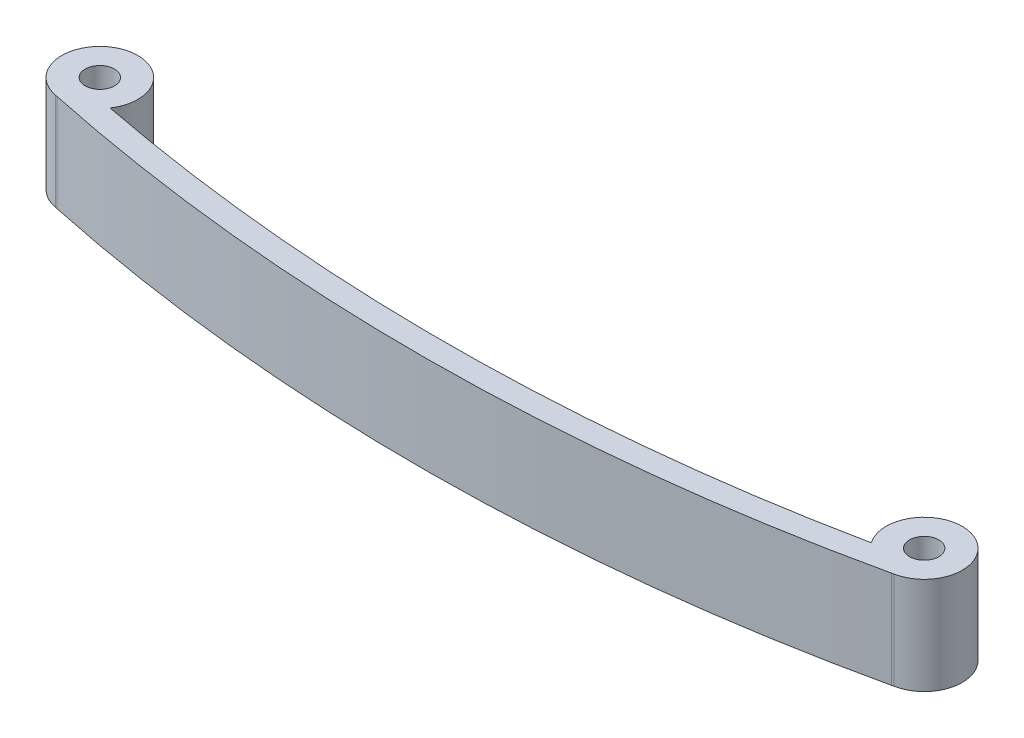
ISO-10303-21;
HEADER;
FILE_DESCRIPTION(('STEP AP214'),'2;1');
FILE_NAME('part.step','',(''),(''),'','','');
FILE_SCHEMA(('AUTOMOTIVE_DESIGN { 1 0 10303 214 1 1 1 1 }'));
ENDSEC;
DATA;
#1=APPLICATION_CONTEXT('core data for automotive mechanical design processes');
#2=APPLICATION_PROTOCOL_DEFINITION('international standard','automotive_design',2000,#1);
#3=PRODUCT_CONTEXT('',#1,'mechanical');
#4=PRODUCT('Part','Part','',(#3));
#5=PRODUCT_RELATED_PRODUCT_CATEGORY('part','',(#4));
#6=PRODUCT_DEFINITION_FORMATION('','',#4);
#7=PRODUCT_DEFINITION_CONTEXT('part definition',#1,'design');
#8=PRODUCT_DEFINITION('design','',#6,#7);
#9=PRODUCT_DEFINITION_SHAPE('','',#8);
#10=(LENGTH_UNIT() NAMED_UNIT(*) SI_UNIT(.MILLI.,.METRE.));
#11=(NAMED_UNIT(*) PLANE_ANGLE_UNIT() SI_UNIT($,.RADIAN.));
#12=(NAMED_UNIT(*) SI_UNIT($,.STERADIAN.) SOLID_ANGLE_UNIT());
#13=UNCERTAINTY_MEASURE_WITH_UNIT(LENGTH_MEASURE(1.E-05),#10,'distance_accuracy_value','');
#14=(GEOMETRIC_REPRESENTATION_CONTEXT(3) GLOBAL_UNCERTAINTY_ASSIGNED_CONTEXT((#13)) GLOBAL_UNIT_ASSIGNED_CONTEXT((#10,
#11,#12)) REPRESENTATION_CONTEXT('',''));
#15=CARTESIAN_POINT('',(0.,0.,0.));
#16=DIRECTION('',(0.,0.,1.));
#17=DIRECTION('',(1.,0.,0.));
#18=AXIS2_PLACEMENT_3D('',#15,#16,#17);
#19=CARTESIAN_POINT('',(-0.864955357142889,8.3,-164.510629845203));
#20=DIRECTION('',(0.,1.,0.));
#21=DIRECTION('',(0.,0.,1.));
#22=AXIS2_PLACEMENT_3D('',#19,#20,#21);
#23=PLANE('',#22);
#24=CARTESIAN_POINT('',(-35.,8.3,-4.14258073909656));
#25=DIRECTION('',(0.,1.,0.));
#26=DIRECTION('',(0.,0.,1.));
#27=AXIS2_PLACEMENT_3D('',#24,#25,#26);
#28=CIRCLE('',#27,1.25);
#29=CARTESIAN_POINT('',(-35.,8.3,-2.89258073909657));
#30=VERTEX_POINT('',#29);
#31=EDGE_CURVE('E134',#30,#30,#28,.T.);
#32=ORIENTED_EDGE('',*,*,#31,.F.);
#33=EDGE_LOOP('',(#32));
#34=FACE_BOUND('',#33,.T.);
#35=CARTESIAN_POINT('',(-0.864955357142889,8.3,-164.510629845203));
#36=DIRECTION('',(0.,-1.,0.));
#37=DIRECTION('',(0.,0.,1.));
#38=AXIS2_PLACEMENT_3D('',#35,#36,#37);
#39=CIRCLE('',#38,165.210703971618);
#40=CARTESIAN_POINT('',(32.3290587197964,8.3,-2.66893516717083));
#41=VERTEX_POINT('',#40);
#42=CARTESIAN_POINT('',(-32.3092176120712,8.3,-2.31989312438794));
#43=VERTEX_POINT('',#42);
#44=EDGE_CURVE('E146',#41,#43,#39,.T.);
#45=ORIENTED_EDGE('',*,*,#44,.T.);
#46=CARTESIAN_POINT('',(-35.,8.3,-4.14258073909656));
#47=DIRECTION('',(0.,1.,0.));
#48=DIRECTION('',(0.,0.,1.));
#49=AXIS2_PLACEMENT_3D('',#46,#47,#48);
#50=CIRCLE('',#49,3.25);
#51=CARTESIAN_POINT('',(-35.5757158370828,8.3,-0.943979283001734));
#52=VERTEX_POINT('',#51);
#53=EDGE_CURVE('E94',#43,#52,#50,.T.);
#54=ORIENTED_EDGE('',*,*,#53,.T.);
#55=DIRECTION('',(0.97628943196104,0.,0.216469270431603));
#56=VECTOR('',#55,1.);
#57=CARTESIAN_POINT('',(-35.413230424207,8.3,-0.907951955828518));
#58=LINE('',#57,#56);
#59=CARTESIAN_POINT('',(-35.413230424207,8.3,-0.907951955828545));
#60=VERTEX_POINT('',#59);
#61=EDGE_CURVE('E107',#52,#60,#58,.T.);
#62=ORIENTED_EDGE('',*,*,#61,.T.);
#63=CARTESIAN_POINT('',(-0.864955357142889,8.3,-164.510629845203));
#64=DIRECTION('',(0.,1.,0.));
#65=DIRECTION('',(0.,0.,1.));
#66=AXIS2_PLACEMENT_3D('',#63,#64,#65);
#67=CIRCLE('',#66,167.210703971618);
#68=CARTESIAN_POINT('',(35.4341722962853,8.3,-1.28749161325972));
#69=VERTEX_POINT('',#68);
#70=EDGE_CURVE('E101',#60,#69,#67,.T.);
#71=ORIENTED_EDGE('',*,*,#70,.T.);
#72=DIRECTION('',(0.974629450610067,0.,-0.223824560769186));
#73=VECTOR('',#72,1.);
#74=CARTESIAN_POINT('',(35.4341722962853,8.3,-1.28749161325972));
#75=LINE('',#74,#73);
#76=CARTESIAN_POINT('',(35.6227279714257,8.3,-1.33079359961198));
#77=VERTEX_POINT('',#76);
#78=EDGE_CURVE('E105',#69,#77,#75,.T.);
#79=ORIENTED_EDGE('',*,*,#78,.T.);
#80=CARTESIAN_POINT('',(35.,8.3,-4.52057570402037));
#81=DIRECTION('',(0.,1.,0.));
#82=DIRECTION('',(0.,0.,1.));
#83=AXIS2_PLACEMENT_3D('',#80,#81,#82);
#84=CIRCLE('',#83,3.25);
#85=EDGE_CURVE('E57',#77,#41,#84,.T.);
#86=ORIENTED_EDGE('',*,*,#85,.T.);
#87=EDGE_LOOP('',(#45,#54,#62,#71,#79,#86));
#88=FACE_BOUND('',#87,.T.);
#89=CARTESIAN_POINT('',(35.,8.3,-4.52057570402037));
#90=DIRECTION('',(0.,1.,0.));
#91=DIRECTION('',(0.,0.,1.));
#92=AXIS2_PLACEMENT_3D('',#89,#90,#91);
#93=CIRCLE('',#92,1.25);
#94=CARTESIAN_POINT('',(35.,8.3,-3.27057570402038));
#95=VERTEX_POINT('',#94);
#96=EDGE_CURVE('E192',#95,#95,#93,.T.);
#97=ORIENTED_EDGE('',*,*,#96,.F.);
#98=EDGE_LOOP('',(#97));
#99=FACE_BOUND('',#98,.T.);
#100=ADVANCED_FACE('F39',(#34,#88,#99),#23,.T.);
#101=CARTESIAN_POINT('',(-0.864955357142889,0.,-164.510629845203));
#102=DIRECTION('',(0.,1.,0.));
#103=DIRECTION('',(0.,0.,1.));
#104=AXIS2_PLACEMENT_3D('',#101,#102,#103);
#105=PLANE('',#104);
#106=CARTESIAN_POINT('',(-0.864955357142889,0.,-164.510629845203));
#107=DIRECTION('',(0.,-1.,0.));
#108=DIRECTION('',(0.,0.,1.));
#109=AXIS2_PLACEMENT_3D('',#106,#107,#108);
#110=CIRCLE('',#109,165.210703971618);
#111=CARTESIAN_POINT('',(32.3290587197964,0.,-2.66893516717083));
#112=VERTEX_POINT('',#111);
#113=CARTESIAN_POINT('',(-32.3092176120712,0.,-2.31989312438794));
#114=VERTEX_POINT('',#113);
#115=EDGE_CURVE('E129',#112,#114,#110,.T.);
#116=ORIENTED_EDGE('',*,*,#115,.F.);
#117=CARTESIAN_POINT('',(35.,0.,-4.52057570402037));
#118=DIRECTION('',(0.,1.,0.));
#119=DIRECTION('',(0.,0.,1.));
#120=AXIS2_PLACEMENT_3D('',#117,#118,#119);
#121=CIRCLE('',#120,3.25);
#122=CARTESIAN_POINT('',(35.6227279714257,0.,-1.33079359961198));
#123=VERTEX_POINT('',#122);
#124=EDGE_CURVE('E86',#123,#112,#121,.T.);
#125=ORIENTED_EDGE('',*,*,#124,.F.);
#126=DIRECTION('',(0.974629450610067,0.,-0.223824560769186));
#127=VECTOR('',#126,1.);
#128=CARTESIAN_POINT('',(35.4341722962853,0.,-1.28749161325972));
#129=LINE('',#128,#127);
#130=CARTESIAN_POINT('',(35.4341722962853,0.,-1.28749161325972));
#131=VERTEX_POINT('',#130);
#132=EDGE_CURVE('E80',#131,#123,#129,.T.);
#133=ORIENTED_EDGE('',*,*,#132,.F.);
#134=CARTESIAN_POINT('',(-0.864955357142889,0.,-164.510629845203));
#135=DIRECTION('',(0.,1.,0.));
#136=DIRECTION('',(0.,0.,1.));
#137=AXIS2_PLACEMENT_3D('',#134,#135,#136);
#138=CIRCLE('',#137,167.210703971618);
#139=CARTESIAN_POINT('',(-35.413230424207,0.,-0.907951955828545));
#140=VERTEX_POINT('',#139);
#141=EDGE_CURVE('E116',#140,#131,#138,.T.);
#142=ORIENTED_EDGE('',*,*,#141,.F.);
#143=DIRECTION('',(0.97628943196104,0.,0.216469270431603));
#144=VECTOR('',#143,1.);
#145=CARTESIAN_POINT('',(-35.413230424207,0.,-0.907951955828518));
#146=LINE('',#145,#144);
#147=CARTESIAN_POINT('',(-35.5757158370828,0.,-0.943979283001734));
#148=VERTEX_POINT('',#147);
#149=EDGE_CURVE('E137',#148,#140,#146,.T.);
#150=ORIENTED_EDGE('',*,*,#149,.F.);
#151=CARTESIAN_POINT('',(-35.,0.,-4.14258073909656));
#152=DIRECTION('',(0.,1.,0.));
#153=DIRECTION('',(0.,0.,1.));
#154=AXIS2_PLACEMENT_3D('',#151,#152,#153);
#155=CIRCLE('',#154,3.25);
#156=EDGE_CURVE('E133',#114,#148,#155,.T.);
#157=ORIENTED_EDGE('',*,*,#156,.F.);
#158=EDGE_LOOP('',(#116,#125,#133,#142,#150,#157));
#159=FACE_BOUND('',#158,.T.);
#160=CARTESIAN_POINT('',(-35.,0.,-4.14258073909656));
#161=DIRECTION('',(0.,1.,0.));
#162=DIRECTION('',(0.,0.,1.));
#163=AXIS2_PLACEMENT_3D('',#160,#161,#162);
#164=CIRCLE('',#163,1.25);
#165=CARTESIAN_POINT('',(-35.,0.,-2.89258073909657));
#166=VERTEX_POINT('',#165);
#167=EDGE_CURVE('E200',#166,#166,#164,.T.);
#168=ORIENTED_EDGE('',*,*,#167,.T.);
#169=EDGE_LOOP('',(#168));
#170=FACE_BOUND('',#169,.T.);
#171=CARTESIAN_POINT('',(35.,0.,-4.52057570402037));
#172=DIRECTION('',(0.,1.,0.));
#173=DIRECTION('',(0.,0.,1.));
#174=AXIS2_PLACEMENT_3D('',#171,#172,#173);
#175=CIRCLE('',#174,1.25);
#176=CARTESIAN_POINT('',(35.,0.,-3.27057570402038));
#177=VERTEX_POINT('',#176);
#178=EDGE_CURVE('E195',#177,#177,#175,.T.);
#179=ORIENTED_EDGE('',*,*,#178,.T.);
#180=EDGE_LOOP('',(#179));
#181=FACE_BOUND('',#180,.T.);
#182=ADVANCED_FACE('F159',(#159,#170,#181),#105,.F.);
#183=CARTESIAN_POINT('',(-0.864955357142889,8.3,-164.510629845203));
#184=DIRECTION('',(0.,-1.,0.));
#185=DIRECTION('',(0.,0.,-1.));
#186=AXIS2_PLACEMENT_3D('',#183,#184,#185);
#187=CYLINDRICAL_SURFACE('',#186,165.210703971618);
#188=ORIENTED_EDGE('',*,*,#115,.T.);
#189=DIRECTION('',(0.,-1.,0.));
#190=VECTOR('',#189,1.);
#191=CARTESIAN_POINT('',(-32.3092176120712,8.3,-2.31989312438794));
#192=LINE('',#191,#190);
#193=EDGE_CURVE('E11',#43,#114,#192,.T.);
#194=ORIENTED_EDGE('',*,*,#193,.F.);
#195=ORIENTED_EDGE('',*,*,#44,.F.);
#196=DIRECTION('',(0.,-1.,0.));
#197=VECTOR('',#196,1.);
#198=CARTESIAN_POINT('',(32.3290587197964,8.3,-2.66893516717083));
#199=LINE('',#198,#197);
#200=EDGE_CURVE('E125',#41,#112,#199,.T.);
#201=ORIENTED_EDGE('',*,*,#200,.T.);
#202=EDGE_LOOP('',(#188,#194,#195,#201));
#203=FACE_BOUND('',#202,.T.);
#204=ADVANCED_FACE('F41',(#203),#187,.F.);
#205=CARTESIAN_POINT('',(-35.,8.3,-4.14258073909656));
#206=DIRECTION('',(0.,-1.,0.));
#207=DIRECTION('',(0.,0.,-1.));
#208=AXIS2_PLACEMENT_3D('',#205,#206,#207);
#209=CYLINDRICAL_SURFACE('',#208,3.25);
#210=ORIENTED_EDGE('',*,*,#156,.T.);
#211=DIRECTION('',(0.,-1.,0.));
#212=VECTOR('',#211,1.);
#213=CARTESIAN_POINT('',(-35.5757158370828,8.3,-0.943979283001734));
#214=LINE('',#213,#212);
#215=EDGE_CURVE('E49',#52,#148,#214,.T.);
#216=ORIENTED_EDGE('',*,*,#215,.F.);
#217=ORIENTED_EDGE('',*,*,#53,.F.);
#218=ORIENTED_EDGE('',*,*,#193,.T.);
#219=EDGE_LOOP('',(#210,#216,#217,#218));
#220=FACE_BOUND('',#219,.T.);
#221=ADVANCED_FACE('F246',(#220),#209,.T.);
#222=CARTESIAN_POINT('',(-35.413230424207,8.3,-0.907951955828518));
#223=DIRECTION('',(0.216469270431603,0.,-0.97628943196104));
#224=DIRECTION('',(-0.97628943196104,0.,-0.216469270431603));
#225=AXIS2_PLACEMENT_3D('',#222,#223,#224);
#226=PLANE('',#225);
#227=ORIENTED_EDGE('',*,*,#149,.T.);
#228=DIRECTION('',(0.,-1.,0.));
#229=VECTOR('',#228,1.);
#230=CARTESIAN_POINT('',(-35.413230424207,8.3,-0.907951955828545));
#231=LINE('',#230,#229);
#232=EDGE_CURVE('E118',#60,#140,#231,.T.);
#233=ORIENTED_EDGE('',*,*,#232,.F.);
#234=ORIENTED_EDGE('',*,*,#61,.F.);
#235=ORIENTED_EDGE('',*,*,#215,.T.);
#236=EDGE_LOOP('',(#227,#233,#234,#235));
#237=FACE_BOUND('',#236,.T.);
#238=ADVANCED_FACE('F156',(#237),#226,.F.);
#239=CARTESIAN_POINT('',(-0.864955357142889,8.3,-164.510629845203));
#240=DIRECTION('',(0.,-1.,0.));
#241=DIRECTION('',(0.,0.,-1.));
#242=AXIS2_PLACEMENT_3D('',#239,#240,#241);
#243=CYLINDRICAL_SURFACE('',#242,167.210703971618);
#244=ORIENTED_EDGE('',*,*,#141,.T.);
#245=DIRECTION('',(0.,-1.,0.));
#246=VECTOR('',#245,1.);
#247=CARTESIAN_POINT('',(35.4341722962853,8.3,-1.28749161325972));
#248=LINE('',#247,#246);
#249=EDGE_CURVE('E113',#69,#131,#248,.T.);
#250=ORIENTED_EDGE('',*,*,#249,.F.);
#251=ORIENTED_EDGE('',*,*,#70,.F.);
#252=ORIENTED_EDGE('',*,*,#232,.T.);
#253=EDGE_LOOP('',(#244,#250,#251,#252));
#254=FACE_BOUND('',#253,.T.);
#255=ADVANCED_FACE('F114',(#254),#243,.T.);
#256=CARTESIAN_POINT('',(35.4341722962853,8.3,-1.28749161325972));
#257=DIRECTION('',(-0.223824560769186,0.,-0.974629450610067));
#258=DIRECTION('',(-0.974629450610067,0.,0.223824560769186));
#259=AXIS2_PLACEMENT_3D('',#256,#257,#258);
#260=PLANE('',#259);
#261=ORIENTED_EDGE('',*,*,#132,.T.);
#262=DIRECTION('',(0.,-1.,0.));
#263=VECTOR('',#262,1.);
#264=CARTESIAN_POINT('',(35.6227279714257,8.3,-1.33079359961198));
#265=LINE('',#264,#263);
#266=EDGE_CURVE('E119',#77,#123,#265,.T.);
#267=ORIENTED_EDGE('',*,*,#266,.F.);
#268=ORIENTED_EDGE('',*,*,#78,.F.);
#269=ORIENTED_EDGE('',*,*,#249,.T.);
#270=EDGE_LOOP('',(#261,#267,#268,#269));
#271=FACE_BOUND('',#270,.T.);
#272=ADVANCED_FACE('F121',(#271),#260,.F.);
#273=CARTESIAN_POINT('',(35.,8.3,-4.52057570402037));
#274=DIRECTION('',(0.,-1.,0.));
#275=DIRECTION('',(0.,0.,-1.));
#276=AXIS2_PLACEMENT_3D('',#273,#274,#275);
#277=CYLINDRICAL_SURFACE('',#276,3.25);
#278=ORIENTED_EDGE('',*,*,#124,.T.);
#279=ORIENTED_EDGE('',*,*,#200,.F.);
#280=ORIENTED_EDGE('',*,*,#85,.F.);
#281=ORIENTED_EDGE('',*,*,#266,.T.);
#282=EDGE_LOOP('',(#278,#279,#280,#281));
#283=FACE_BOUND('',#282,.T.);
#284=ADVANCED_FACE('F164',(#283),#277,.T.);
#285=CARTESIAN_POINT('',(-35.,8.3,-4.14258073909656));
#286=DIRECTION('',(0.,-1.,0.));
#287=DIRECTION('',(0.,0.,-1.));
#288=AXIS2_PLACEMENT_3D('',#285,#286,#287);
#289=CYLINDRICAL_SURFACE('',#288,1.25);
#290=ORIENTED_EDGE('',*,*,#31,.T.);
#291=EDGE_LOOP('',(#290));
#292=FACE_BOUND('',#291,.T.);
#293=ORIENTED_EDGE('',*,*,#167,.F.);
#294=EDGE_LOOP('',(#293));
#295=FACE_BOUND('',#294,.T.);
#296=ADVANCED_FACE('F166',(#292,#295),#289,.F.);
#297=CARTESIAN_POINT('',(35.,8.3,-4.52057570402037));
#298=DIRECTION('',(0.,-1.,0.));
#299=DIRECTION('',(0.,0.,-1.));
#300=AXIS2_PLACEMENT_3D('',#297,#298,#299);
#301=CYLINDRICAL_SURFACE('',#300,1.25);
#302=ORIENTED_EDGE('',*,*,#96,.T.);
#303=EDGE_LOOP('',(#302));
#304=FACE_BOUND('',#303,.T.);
#305=ORIENTED_EDGE('',*,*,#178,.F.);
#306=EDGE_LOOP('',(#305));
#307=FACE_BOUND('',#306,.T.);
#308=ADVANCED_FACE('F172',(#304,#307),#301,.F.);
#309=CLOSED_SHELL('',(#100,#182,#204,#221,#238,#255,#272,#284,#296,#308));
#310=MANIFOLD_SOLID_BREP('B2',#309);
#311=ADVANCED_BREP_SHAPE_REPRESENTATION('',(#18,#310),#14);
#312=SHAPE_DEFINITION_REPRESENTATION(#9,#311);
ENDSEC;
END-ISO-10303-21;
